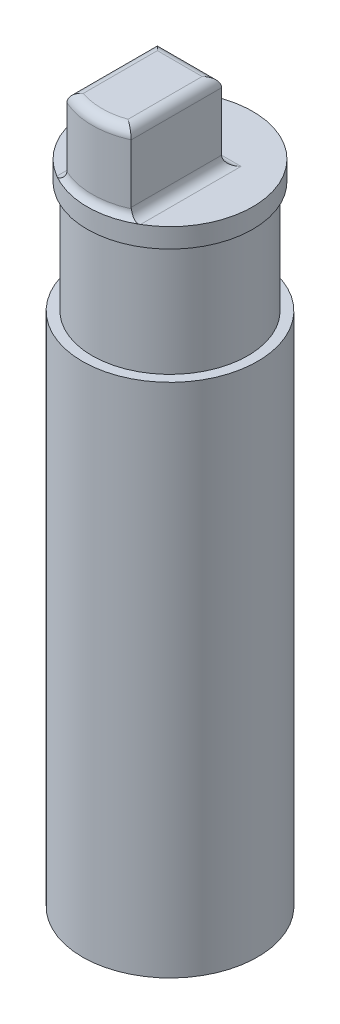
ISO-10303-21;
HEADER;
FILE_DESCRIPTION(('STEP AP214'),'2;1');
FILE_NAME('part.step','',(''),(''),'','','');
FILE_SCHEMA(('AUTOMOTIVE_DESIGN { 1 0 10303 214 1 1 1 1 }'));
ENDSEC;
DATA;
#1=APPLICATION_CONTEXT('core data for automotive mechanical design processes');
#2=APPLICATION_PROTOCOL_DEFINITION('international standard','automotive_design',2000,#1);
#3=PRODUCT_CONTEXT('',#1,'mechanical');
#4=PRODUCT('Part','Part','',(#3));
#5=PRODUCT_RELATED_PRODUCT_CATEGORY('part','',(#4));
#6=PRODUCT_DEFINITION_FORMATION('','',#4);
#7=PRODUCT_DEFINITION_CONTEXT('part definition',#1,'design');
#8=PRODUCT_DEFINITION('design','',#6,#7);
#9=PRODUCT_DEFINITION_SHAPE('','',#8);
#10=(LENGTH_UNIT() NAMED_UNIT(*) SI_UNIT(.MILLI.,.METRE.));
#11=(NAMED_UNIT(*) PLANE_ANGLE_UNIT() SI_UNIT($,.RADIAN.));
#12=(NAMED_UNIT(*) SI_UNIT($,.STERADIAN.) SOLID_ANGLE_UNIT());
#13=UNCERTAINTY_MEASURE_WITH_UNIT(LENGTH_MEASURE(1.E-05),#10,'distance_accuracy_value','');
#14=(GEOMETRIC_REPRESENTATION_CONTEXT(3) GLOBAL_UNCERTAINTY_ASSIGNED_CONTEXT((#13)) GLOBAL_UNIT_ASSIGNED_CONTEXT((#10,
#11,#12)) REPRESENTATION_CONTEXT('',''));
#15=CARTESIAN_POINT('',(0.,0.,0.));
#16=DIRECTION('',(0.,0.,1.));
#17=DIRECTION('',(1.,0.,0.));
#18=AXIS2_PLACEMENT_3D('',#15,#16,#17);
#19=CARTESIAN_POINT('',(0.,66.5,0.));
#20=DIRECTION('',(0.,1.,0.));
#21=DIRECTION('',(0.,0.,1.));
#22=AXIS2_PLACEMENT_3D('',#19,#20,#21);
#23=PLANE('',#22);
#24=DIRECTION('',(-1.,0.,0.));
#25=VECTOR('',#24,1.);
#26=CARTESIAN_POINT('',(0.,66.5,-3.));
#27=LINE('',#26,#25);
#28=CARTESIAN_POINT('',(-4.3,66.5,-3.));
#29=VERTEX_POINT('',#28);
#30=CARTESIAN_POINT('',(4.3,66.5,-3.));
#31=VERTEX_POINT('',#30);
#32=EDGE_CURVE('E151',#29,#31,#27,.F.);
#33=ORIENTED_EDGE('',*,*,#32,.T.);
#34=DIRECTION('',(0.,0.,-1.));
#35=VECTOR('',#34,1.);
#36=CARTESIAN_POINT('',(4.3,66.5,0.));
#37=LINE('',#36,#35);
#38=CARTESIAN_POINT('',(4.3,66.5,7.33212111192935));
#39=VERTEX_POINT('',#38);
#40=EDGE_CURVE('E135',#31,#39,#37,.F.);
#41=ORIENTED_EDGE('',*,*,#40,.T.);
#42=CARTESIAN_POINT('',(0.,66.5,0.));
#43=DIRECTION('',(0.,1.,0.));
#44=DIRECTION('',(0.,0.,1.));
#45=AXIS2_PLACEMENT_3D('',#42,#43,#44);
#46=CIRCLE('',#45,8.5);
#47=CARTESIAN_POINT('',(-4.3,66.5,7.33212111192935));
#48=VERTEX_POINT('',#47);
#49=EDGE_CURVE('E267',#39,#48,#46,.T.);
#50=ORIENTED_EDGE('',*,*,#49,.T.);
#51=DIRECTION('',(0.,0.,1.));
#52=VECTOR('',#51,1.);
#53=CARTESIAN_POINT('',(-4.3,66.5,0.));
#54=LINE('',#53,#52);
#55=EDGE_CURVE('E148',#48,#29,#54,.F.);
#56=ORIENTED_EDGE('',*,*,#55,.T.);
#57=EDGE_LOOP('',(#33,#41,#50,#56));
#58=FACE_BOUND('',#57,.T.);
#59=ADVANCED_FACE('F38',(#58),#23,.T.);
#60=CARTESIAN_POINT('',(0.,53.,0.));
#61=DIRECTION('',(0.,1.,0.));
#62=DIRECTION('',(0.,0.,1.));
#63=AXIS2_PLACEMENT_3D('',#60,#61,#62);
#64=PLANE('',#63);
#65=CARTESIAN_POINT('',(0.,53.,0.));
#66=DIRECTION('',(0.,1.,0.));
#67=DIRECTION('',(0.,0.,1.));
#68=AXIS2_PLACEMENT_3D('',#65,#66,#67);
#69=CIRCLE('',#68,9.);
#70=CARTESIAN_POINT('',(0.,53.,9.));
#71=VERTEX_POINT('',#70);
#72=EDGE_CURVE('E149',#71,#71,#69,.T.);
#73=ORIENTED_EDGE('',*,*,#72,.T.);
#74=EDGE_LOOP('',(#73));
#75=FACE_BOUND('',#74,.T.);
#76=CARTESIAN_POINT('',(0.,53.,0.));
#77=DIRECTION('',(0.,1.,0.));
#78=DIRECTION('',(0.,0.,1.));
#79=AXIS2_PLACEMENT_3D('',#76,#77,#78);
#80=CIRCLE('',#79,8.);
#81=CARTESIAN_POINT('',(0.,53.,8.));
#82=VERTEX_POINT('',#81);
#83=EDGE_CURVE('E270',#82,#82,#80,.T.);
#84=ORIENTED_EDGE('',*,*,#83,.F.);
#85=EDGE_LOOP('',(#84));
#86=FACE_BOUND('',#85,.T.);
#87=ADVANCED_FACE('F281',(#75,#86),#64,.T.);
#88=CARTESIAN_POINT('',(0.,53.,0.));
#89=DIRECTION('',(0.,-1.,0.));
#90=DIRECTION('',(0.,0.,-1.));
#91=AXIS2_PLACEMENT_3D('',#88,#89,#90);
#92=CYLINDRICAL_SURFACE('',#91,9.);
#93=ORIENTED_EDGE('',*,*,#72,.F.);
#94=EDGE_LOOP('',(#93));
#95=FACE_BOUND('',#94,.T.);
#96=CARTESIAN_POINT('',(0.,0.,0.));
#97=DIRECTION('',(0.,1.,0.));
#98=DIRECTION('',(0.,0.,1.));
#99=AXIS2_PLACEMENT_3D('',#96,#97,#98);
#100=CIRCLE('',#99,9.);
#101=CARTESIAN_POINT('',(0.,0.,9.));
#102=VERTEX_POINT('',#101);
#103=EDGE_CURVE('E154',#102,#102,#100,.T.);
#104=ORIENTED_EDGE('',*,*,#103,.T.);
#105=EDGE_LOOP('',(#104));
#106=FACE_BOUND('',#105,.T.);
#107=ADVANCED_FACE('F283',(#95,#106),#92,.T.);
#108=CARTESIAN_POINT('',(0.,0.,0.));
#109=DIRECTION('',(0.,1.,0.));
#110=DIRECTION('',(0.,0.,1.));
#111=AXIS2_PLACEMENT_3D('',#108,#109,#110);
#112=PLANE('',#111);
#113=ORIENTED_EDGE('',*,*,#103,.F.);
#114=EDGE_LOOP('',(#113));
#115=FACE_BOUND('',#114,.T.);
#116=ADVANCED_FACE('F290',(#115),#112,.F.);
#117=CARTESIAN_POINT('',(0.,64.5,0.));
#118=DIRECTION('',(0.,-1.,0.));
#119=DIRECTION('',(0.,0.,-1.));
#120=AXIS2_PLACEMENT_3D('',#117,#118,#119);
#121=CYLINDRICAL_SURFACE('',#120,8.);
#122=CARTESIAN_POINT('',(0.,64.5,0.));
#123=DIRECTION('',(0.,1.,0.));
#124=DIRECTION('',(0.,0.,1.));
#125=AXIS2_PLACEMENT_3D('',#122,#123,#124);
#126=CIRCLE('',#125,8.);
#127=CARTESIAN_POINT('',(0.,64.5,8.));
#128=VERTEX_POINT('',#127);
#129=EDGE_CURVE('E273',#128,#128,#126,.T.);
#130=ORIENTED_EDGE('',*,*,#129,.F.);
#131=EDGE_LOOP('',(#130));
#132=FACE_BOUND('',#131,.T.);
#133=ORIENTED_EDGE('',*,*,#83,.T.);
#134=EDGE_LOOP('',(#133));
#135=FACE_BOUND('',#134,.T.);
#136=ADVANCED_FACE('F279',(#132,#135),#121,.T.);
#137=CARTESIAN_POINT('',(0.,64.5,0.));
#138=DIRECTION('',(0.,1.,0.));
#139=DIRECTION('',(0.,0.,1.));
#140=AXIS2_PLACEMENT_3D('',#137,#138,#139);
#141=PLANE('',#140);
#142=CARTESIAN_POINT('',(0.,64.5,0.));
#143=DIRECTION('',(0.,1.,0.));
#144=DIRECTION('',(0.,0.,1.));
#145=AXIS2_PLACEMENT_3D('',#142,#143,#144);
#146=CIRCLE('',#145,8.5);
#147=CARTESIAN_POINT('',(0.,64.5,8.5));
#148=VERTEX_POINT('',#147);
#149=EDGE_CURVE('E252',#148,#148,#146,.T.);
#150=ORIENTED_EDGE('',*,*,#149,.F.);
#151=EDGE_LOOP('',(#150));
#152=FACE_BOUND('',#151,.T.);
#153=ORIENTED_EDGE('',*,*,#129,.T.);
#154=EDGE_LOOP('',(#153));
#155=FACE_BOUND('',#154,.T.);
#156=ADVANCED_FACE('F301',(#152,#155),#141,.F.);
#157=CARTESIAN_POINT('',(0.,66.5,0.));
#158=DIRECTION('',(0.,-1.,0.));
#159=DIRECTION('',(0.,0.,-1.));
#160=AXIS2_PLACEMENT_3D('',#157,#158,#159);
#161=CYLINDRICAL_SURFACE('',#160,8.5);
#162=ORIENTED_EDGE('',*,*,#49,.F.);
#163=EDGE_CURVE('E251',#48,#39,#46,.T.);
#164=ORIENTED_EDGE('',*,*,#163,.F.);
#165=EDGE_LOOP('',(#162,#164));
#166=FACE_BOUND('',#165,.T.);
#167=ORIENTED_EDGE('',*,*,#149,.T.);
#168=EDGE_LOOP('',(#167));
#169=FACE_BOUND('',#168,.T.);
#170=ADVANCED_FACE('F309',(#166,#169),#161,.T.);
#171=CARTESIAN_POINT('',(0.,74.5,0.));
#172=DIRECTION('',(0.,-1.,0.));
#173=DIRECTION('',(0.,0.,-1.));
#174=AXIS2_PLACEMENT_3D('',#171,#172,#173);
#175=CYLINDRICAL_SURFACE('',#174,8.);
#176=DIRECTION('',(0.,-1.,0.));
#177=VECTOR('',#176,1.);
#178=CARTESIAN_POINT('',(3.3,74.5,7.28766080440082));
#179=LINE('',#178,#177);
#180=CARTESIAN_POINT('',(3.3,73.5,7.28766080440082));
#181=VERTEX_POINT('',#180);
#182=CARTESIAN_POINT('',(3.3,67.5,7.28766080440082));
#183=VERTEX_POINT('',#182);
#184=EDGE_CURVE('E123',#181,#183,#179,.T.);
#185=ORIENTED_EDGE('',*,*,#184,.F.);
#186=CARTESIAN_POINT('',(0.,73.5,0.));
#187=DIRECTION('',(0.,1.,0.));
#188=DIRECTION('',(0.,0.,1.));
#189=AXIS2_PLACEMENT_3D('',#186,#187,#188);
#190=CIRCLE('',#189,8.);
#191=CARTESIAN_POINT('',(-3.3,73.5,7.28766080440082));
#192=VERTEX_POINT('',#191);
#193=EDGE_CURVE('E51',#181,#192,#190,.F.);
#194=ORIENTED_EDGE('',*,*,#193,.T.);
#195=DIRECTION('',(0.,-1.,0.));
#196=VECTOR('',#195,1.);
#197=CARTESIAN_POINT('',(-3.3,74.5,7.28766080440082));
#198=LINE('',#197,#196);
#199=CARTESIAN_POINT('',(-3.3,67.5,7.28766080440082));
#200=VERTEX_POINT('',#199);
#201=EDGE_CURVE('E201',#192,#200,#198,.T.);
#202=ORIENTED_EDGE('',*,*,#201,.T.);
#203=CARTESIAN_POINT('',(-3.3,67.5,7.28766080440082));
#204=CARTESIAN_POINT('',(-3.30000308955078,67.4775492189389,7.28766024476836));
#205=CARTESIAN_POINT('',(-3.30075590377899,67.4551592787231,7.28731921469493));
#206=CARTESIAN_POINT('',(-3.30376098159002,67.4105010799846,7.28595621366625));
#207=CARTESIAN_POINT('',(-3.30601324517264,67.3882328214619,7.28493424271109));
#208=CARTESIAN_POINT('',(-3.30901523343248,67.3660254037844,7.28357180131505));
#209=B_SPLINE_CURVE_WITH_KNOTS('',3,(#203,#204,#205,#206,#207,#208),.UNSPECIFIED.,.F.,.F.,(4,2,
4),(0.,0.0672155642898421,0.134431128570596),.UNSPECIFIED.);
#210=CARTESIAN_POINT('',(-3.30901523343248,67.3660254037844,7.28357180131505));
#211=VERTEX_POINT('',#210);
#212=EDGE_CURVE('E171',#200,#211,#209,.T.);
#213=ORIENTED_EDGE('',*,*,#212,.T.);
#214=CARTESIAN_POINT('',(0.,67.3660254037844,0.));
#215=DIRECTION('',(0.,-1.,0.));
#216=DIRECTION('',(0.,0.,-1.));
#217=AXIS2_PLACEMENT_3D('',#214,#215,#216);
#218=CIRCLE('',#217,8.);
#219=CARTESIAN_POINT('',(3.30901523343248,67.3660254037844,7.28357180131505));
#220=VERTEX_POINT('',#219);
#221=EDGE_CURVE('E162',#211,#220,#218,.F.);
#222=ORIENTED_EDGE('',*,*,#221,.T.);
#223=CARTESIAN_POINT('',(3.30901523343248,67.3660254037844,7.28357180131505));
#224=CARTESIAN_POINT('',(3.30601324517264,67.3882328214619,7.28493424271109));
#225=CARTESIAN_POINT('',(3.30376098159002,67.4105010799845,7.28595621366625));
#226=CARTESIAN_POINT('',(3.30075590377899,67.455159278723,7.28731921469493));
#227=CARTESIAN_POINT('',(3.30000308955079,67.4775492189389,7.28766024476836));
#228=CARTESIAN_POINT('',(3.3,67.5,7.28766080440082));
#229=B_SPLINE_CURVE_WITH_KNOTS('',3,(#223,#224,#225,#226,#227,#228),.UNSPECIFIED.,.F.,.F.,(4,2,
4),(0.,0.0672155642807403,0.134431128570582),.UNSPECIFIED.);
#230=EDGE_CURVE('E164',#220,#183,#229,.T.);
#231=ORIENTED_EDGE('',*,*,#230,.T.);
#232=EDGE_LOOP('',(#185,#194,#202,#213,#222,#231));
#233=FACE_BOUND('',#232,.T.);
#234=ADVANCED_FACE('F176',(#233),#175,.T.);
#235=CARTESIAN_POINT('',(3.3,74.5,7.28766080440082));
#236=DIRECTION('',(-1.,0.,0.));
#237=DIRECTION('',(0.,0.,1.));
#238=AXIS2_PLACEMENT_3D('',#235,#236,#237);
#239=PLANE('',#238);
#240=DIRECTION('',(0.,-1.,0.));
#241=VECTOR('',#240,1.);
#242=CARTESIAN_POINT('',(3.3,74.5,-2.));
#243=LINE('',#242,#241);
#244=CARTESIAN_POINT('',(3.3,73.5,-2.));
#245=VERTEX_POINT('',#244);
#246=CARTESIAN_POINT('',(3.3,67.5,-2.));
#247=VERTEX_POINT('',#246);
#248=EDGE_CURVE('E113',#245,#247,#243,.T.);
#249=ORIENTED_EDGE('',*,*,#248,.F.);
#250=DIRECTION('',(0.,0.,-1.));
#251=VECTOR('',#250,1.);
#252=CARTESIAN_POINT('',(3.3,73.5,7.28766080440082));
#253=LINE('',#252,#251);
#254=EDGE_CURVE('E11',#245,#181,#253,.F.);
#255=ORIENTED_EDGE('',*,*,#254,.T.);
#256=ORIENTED_EDGE('',*,*,#184,.T.);
#257=DIRECTION('',(0.,0.,-1.));
#258=VECTOR('',#257,1.);
#259=CARTESIAN_POINT('',(3.3,67.5,7.28766080440082));
#260=LINE('',#259,#258);
#261=EDGE_CURVE('E133',#183,#247,#260,.T.);
#262=ORIENTED_EDGE('',*,*,#261,.T.);
#263=EDGE_LOOP('',(#249,#255,#256,#262));
#264=FACE_BOUND('',#263,.T.);
#265=ADVANCED_FACE('F146',(#264),#239,.F.);
#266=CARTESIAN_POINT('',(-3.3,74.5,-2.));
#267=DIRECTION('',(0.,0.,1.));
#268=DIRECTION('',(1.,0.,0.));
#269=AXIS2_PLACEMENT_3D('',#266,#267,#268);
#270=PLANE('',#269);
#271=DIRECTION('',(0.,-1.,0.));
#272=VECTOR('',#271,1.);
#273=CARTESIAN_POINT('',(-3.3,74.5,-2.));
#274=LINE('',#273,#272);
#275=CARTESIAN_POINT('',(-3.3,73.5,-2.));
#276=VERTEX_POINT('',#275);
#277=CARTESIAN_POINT('',(-3.3,67.5,-2.));
#278=VERTEX_POINT('',#277);
#279=EDGE_CURVE('E124',#276,#278,#274,.T.);
#280=ORIENTED_EDGE('',*,*,#279,.F.);
#281=DIRECTION('',(-1.,0.,0.));
#282=VECTOR('',#281,1.);
#283=CARTESIAN_POINT('',(3.3,73.5,-2.));
#284=LINE('',#283,#282);
#285=EDGE_CURVE('E121',#276,#245,#284,.F.);
#286=ORIENTED_EDGE('',*,*,#285,.T.);
#287=ORIENTED_EDGE('',*,*,#248,.T.);
#288=DIRECTION('',(-1.,0.,0.));
#289=VECTOR('',#288,1.);
#290=CARTESIAN_POINT('',(-3.3,67.5,-2.));
#291=LINE('',#290,#289);
#292=EDGE_CURVE('E118',#247,#278,#291,.T.);
#293=ORIENTED_EDGE('',*,*,#292,.T.);
#294=EDGE_LOOP('',(#280,#286,#287,#293));
#295=FACE_BOUND('',#294,.T.);
#296=ADVANCED_FACE('F116',(#295),#270,.F.);
#297=CARTESIAN_POINT('',(-3.3,74.5,7.28766080440082));
#298=DIRECTION('',(1.,0.,0.));
#299=DIRECTION('',(0.,0.,-1.));
#300=AXIS2_PLACEMENT_3D('',#297,#298,#299);
#301=PLANE('',#300);
#302=ORIENTED_EDGE('',*,*,#201,.F.);
#303=DIRECTION('',(0.,0.,1.));
#304=VECTOR('',#303,1.);
#305=CARTESIAN_POINT('',(-3.3,73.5,-2.));
#306=LINE('',#305,#304);
#307=EDGE_CURVE('E231',#192,#276,#306,.F.);
#308=ORIENTED_EDGE('',*,*,#307,.T.);
#309=ORIENTED_EDGE('',*,*,#279,.T.);
#310=DIRECTION('',(0.,0.,1.));
#311=VECTOR('',#310,1.);
#312=CARTESIAN_POINT('',(-3.3,67.5,7.28766080440082));
#313=LINE('',#312,#311);
#314=EDGE_CURVE('E144',#278,#200,#313,.T.);
#315=ORIENTED_EDGE('',*,*,#314,.T.);
#316=EDGE_LOOP('',(#302,#308,#309,#315));
#317=FACE_BOUND('',#316,.T.);
#318=ADVANCED_FACE('F263',(#317),#301,.F.);
#319=CARTESIAN_POINT('',(0.,74.5,0.));
#320=DIRECTION('',(0.,1.,0.));
#321=DIRECTION('',(0.,0.,1.));
#322=AXIS2_PLACEMENT_3D('',#319,#320,#321);
#323=PLANE('',#322);
#324=DIRECTION('',(0.,0.,-1.));
#325=VECTOR('',#324,1.);
#326=CARTESIAN_POINT('',(2.3,74.5,-2.));
#327=LINE('',#326,#325);
#328=CARTESIAN_POINT('',(2.3,74.5,6.61135387042624));
#329=VERTEX_POINT('',#328);
#330=CARTESIAN_POINT('',(2.3,74.5,-1.));
#331=VERTEX_POINT('',#330);
#332=EDGE_CURVE('E202',#329,#331,#327,.T.);
#333=ORIENTED_EDGE('',*,*,#332,.T.);
#334=DIRECTION('',(-1.,0.,0.));
#335=VECTOR('',#334,1.);
#336=CARTESIAN_POINT('',(-3.3,74.5,-1.));
#337=LINE('',#336,#335);
#338=CARTESIAN_POINT('',(-2.3,74.5,-1.));
#339=VERTEX_POINT('',#338);
#340=EDGE_CURVE('E234',#331,#339,#337,.T.);
#341=ORIENTED_EDGE('',*,*,#340,.T.);
#342=DIRECTION('',(0.,0.,1.));
#343=VECTOR('',#342,1.);
#344=CARTESIAN_POINT('',(-2.3,74.5,7.28766080440082));
#345=LINE('',#344,#343);
#346=CARTESIAN_POINT('',(-2.3,74.5,6.61135387042624));
#347=VERTEX_POINT('',#346);
#348=EDGE_CURVE('E237',#339,#347,#345,.T.);
#349=ORIENTED_EDGE('',*,*,#348,.T.);
#350=CARTESIAN_POINT('',(0.,74.5,0.));
#351=DIRECTION('',(0.,1.,0.));
#352=DIRECTION('',(0.,0.,1.));
#353=AXIS2_PLACEMENT_3D('',#350,#351,#352);
#354=CIRCLE('',#353,7.);
#355=EDGE_CURVE('E238',#347,#329,#354,.T.);
#356=ORIENTED_EDGE('',*,*,#355,.T.);
#357=EDGE_LOOP('',(#333,#341,#349,#356));
#358=FACE_BOUND('',#357,.T.);
#359=ADVANCED_FACE('F208',(#358),#323,.T.);
#360=CARTESIAN_POINT('',(-4.3,67.5,7.28766080440082));
#361=DIRECTION('',(0.,0.,1.));
#362=DIRECTION('',(1.,0.,0.));
#363=AXIS2_PLACEMENT_3D('',#360,#361,#362);
#364=CYLINDRICAL_SURFACE('',#363,1.);
#365=CARTESIAN_POINT('',(-4.3,67.5,-3.));
#366=DIRECTION('',(-0.707106781186547,0.,0.707106781186547));
#367=DIRECTION('',(0.707106781186547,0.,0.707106781186547));
#368=AXIS2_PLACEMENT_3D('',#365,#366,#367);
#369=ELLIPSE('',#368,1.41421356237309,1.);
#370=EDGE_CURVE('E143',#29,#278,#369,.T.);
#371=ORIENTED_EDGE('',*,*,#370,.F.);
#372=ORIENTED_EDGE('',*,*,#55,.F.);
#373=CARTESIAN_POINT('',(-3.30901523343248,67.3660254037844,7.28357180131505));
#374=CARTESIAN_POINT('',(-3.31246456784373,67.3404963803781,7.28200202477436));
#375=CARTESIAN_POINT('',(-3.31690808119818,67.3150789864093,7.28105755123476));
#376=CARTESIAN_POINT('',(-3.32774503509767,67.2646608978251,7.28034614149764));
#377=CARTESIAN_POINT('',(-3.33413738508469,67.2396599783839,7.28057854785725));
#378=CARTESIAN_POINT('',(-3.35609190501821,67.1658506992066,7.28291988229461));
#379=CARTESIAN_POINT('',(-3.37447751602998,67.117899087276,7.28665451040913));
#380=CARTESIAN_POINT('',(-3.41809812552044,67.025819900509,7.29759957547721));
#381=CARTESIAN_POINT('',(-3.4433208840435,66.9816856762093,7.30480381880853));
#382=CARTESIAN_POINT('',(-3.49992307068257,66.8979753513472,7.32158795704004));
#383=CARTESIAN_POINT('',(-3.53131266951215,66.8584069544942,7.33117178347132));
#384=CARTESIAN_POINT('',(-3.60200243242958,66.7818690001788,7.35208166721237));
#385=CARTESIAN_POINT('',(-3.64171308398208,66.7453007522791,7.36348386514897));
#386=CARTESIAN_POINT('',(-3.72670871688435,66.6788771953604,7.38521996639569));
#387=CARTESIAN_POINT('',(-3.77199259093424,66.6490205561856,7.39555408116663));
#388=CARTESIAN_POINT('',(-3.85168394288901,66.6053811469845,7.4089606917193));
#389=CARTESIAN_POINT('',(-3.88475319178211,66.5895446299238,7.41330404396053));
#390=CARTESIAN_POINT('',(-3.95263959965505,66.5615556154165,7.41829416274078));
#391=CARTESIAN_POINT('',(-3.98745062103927,66.5493911161113,7.41895309818859));
#392=CARTESIAN_POINT('',(-4.05151866232284,66.5308983003173,7.41511983942148));
#393=CARTESIAN_POINT('',(-4.08063357018009,66.5239107631326,7.41154322763757));
#394=CARTESIAN_POINT('',(-4.13853512275789,66.5126821175767,7.39993050857802));
#395=CARTESIAN_POINT('',(-4.16732180753234,66.5084406704919,7.39189495151353));
#396=CARTESIAN_POINT('',(-4.21351580272938,66.5035790593016,7.37508851697309));
#397=CARTESIAN_POINT('',(-4.23132829956207,66.5022074237802,7.36759608010559));
#398=CARTESIAN_POINT('',(-4.26623472968663,66.5004176321197,7.35100849729078));
#399=CARTESIAN_POINT('',(-4.28332896583291,66.4999990700759,7.34191403540892));
#400=CARTESIAN_POINT('',(-4.3,66.5,7.33212111192935));
#401=B_SPLINE_CURVE_WITH_KNOTS('',3,(#373,#374,#375,#376,#377,#378,#379,#380,#381,#382,#383,
#384,#385,#386,#387,#388,#389,#390,#391,#392,#393,#394,#395,#396,#397,#398,#399,#400),
.UNSPECIFIED.,.F.,.F.,(4,2,2,2,2,2,2,2,2,2,2,2,2,4),(0.,0.0773705106424727,0.154697804406726,
0.308345837484571,0.461720603864883,0.615350481158227,0.780208802498562,0.945034422148909,
1.05550206044417,1.16560462922901,1.25567069587078,1.345725651289,1.40374514962373,
1.46173993339426),.UNSPECIFIED.);
#402=EDGE_CURVE('E195',#211,#48,#401,.T.);
#403=ORIENTED_EDGE('',*,*,#402,.F.);
#404=ORIENTED_EDGE('',*,*,#212,.F.);
#405=ORIENTED_EDGE('',*,*,#314,.F.);
#406=EDGE_LOOP('',(#371,#372,#403,#404,#405));
#407=FACE_BOUND('',#406,.T.);
#408=ADVANCED_FACE('F204',(#407),#364,.F.);
#409=CARTESIAN_POINT('',(0.,67.3660254037844,0.));
#410=DIRECTION('',(0.,-1.,0.));
#411=DIRECTION('',(0.,0.,-1.));
#412=AXIS2_PLACEMENT_3D('',#409,#410,#411);
#413=TOROIDAL_SURFACE('',#412,9.,1.);
#414=ORIENTED_EDGE('',*,*,#402,.T.);
#415=ORIENTED_EDGE('',*,*,#163,.T.);
#416=CARTESIAN_POINT('',(4.3,66.5,7.33212111192934));
#417=CARTESIAN_POINT('',(4.28439517078444,66.5000011961552,7.3412789345809));
#418=CARTESIAN_POINT('',(4.26843028838506,66.5003664663718,7.3498319844296));
#419=CARTESIAN_POINT('',(4.2358612452299,66.501924873276,7.3655497771866));
#420=CARTESIAN_POINT('',(4.21925671596317,66.5031184941361,7.3727137050157));
#421=CARTESIAN_POINT('',(4.16927392109373,66.508028140556,7.39159610269089));
#422=CARTESIAN_POINT('',(4.13512630259104,66.5130660964168,7.40106597279926));
#423=CARTESIAN_POINT('',(4.06642234586707,66.5270266219958,7.413802103621));
#424=CARTESIAN_POINT('',(4.0318650411024,66.5359617405964,7.41704813982387));
#425=CARTESIAN_POINT('',(3.96372640707345,66.5575518636163,7.41872610732216));
#426=CARTESIAN_POINT('',(3.9301502266978,66.5702235881686,7.41713609435254));
#427=CARTESIAN_POINT('',(3.85089164965909,66.60507387946,7.40950934174041));
#428=CARTESIAN_POINT('',(3.80614888753835,66.6290024643583,7.40186616930271));
#429=CARTESIAN_POINT('',(3.72113978437736,66.6830134034114,7.38401132081926));
#430=CARTESIAN_POINT('',(3.68087985861722,66.7131044060787,7.37379603031466));
#431=CARTESIAN_POINT('',(3.60373983535505,66.7803171033482,7.35270369550476));
#432=CARTESIAN_POINT('',(3.56707251309643,66.8176808758705,7.34181687162733));
#433=CARTESIAN_POINT('',(3.49983944260301,66.8979355947281,7.32164561247554));
#434=CARTESIAN_POINT('',(3.46927292809012,66.9408258458075,7.31236097598193));
#435=CARTESIAN_POINT('',(3.41297343171011,67.0348017941752,7.29621895245351));
#436=CARTESIAN_POINT('',(3.38779399867238,67.086264267508,7.28960356800613));
#437=CARTESIAN_POINT('',(3.34657048016316,67.1930387075782,7.28134147394502));
#438=CARTESIAN_POINT('',(3.33050048508431,67.2483392491354,7.27968061435493));
#439=CARTESIAN_POINT('',(3.31727140319661,67.3146496942701,7.28120814671517));
#440=CARTESIAN_POINT('',(3.31539373952559,67.3249006505036,7.28154182930495));
#441=CARTESIAN_POINT('',(3.31196276072953,67.3454364537915,7.28240758751987));
#442=CARTESIAN_POINT('',(3.31040908179199,67.3557212495138,7.28293943872379));
#443=CARTESIAN_POINT('',(3.30901523343248,67.3660254037844,7.28357180131505));
#444=B_SPLINE_CURVE_WITH_KNOTS('',3,(#416,#417,#418,#419,#420,#421,#422,#423,#424,#425,#426,
#427,#428,#429,#430,#431,#432,#433,#434,#435,#436,#437,#438,#439,#440,#441,#442,#443),
.UNSPECIFIED.,.F.,.F.,(4,2,2,2,2,2,2,2,2,2,2,2,2,4),(0.,0.0542639799180423,0.108559703976039,
0.215089415553723,0.321964715384058,0.429325699568787,0.582445952381603,0.735782589563756,
0.895554918787222,1.05530716752401,1.22736264918168,1.39892627277646,1.43020373788822,
1.46144588914484),.UNSPECIFIED.);
#445=EDGE_CURVE('E138',#220,#39,#444,.F.);
#446=ORIENTED_EDGE('',*,*,#445,.F.);
#447=ORIENTED_EDGE('',*,*,#221,.F.);
#448=EDGE_LOOP('',(#414,#415,#446,#447));
#449=FACE_BOUND('',#448,.T.);
#450=ADVANCED_FACE('F185',(#449),#413,.F.);
#451=CARTESIAN_POINT('',(-3.3,67.5,-3.));
#452=DIRECTION('',(-1.,0.,0.));
#453=DIRECTION('',(0.,0.,1.));
#454=AXIS2_PLACEMENT_3D('',#451,#452,#453);
#455=CYLINDRICAL_SURFACE('',#454,1.);
#456=ORIENTED_EDGE('',*,*,#370,.T.);
#457=ORIENTED_EDGE('',*,*,#292,.F.);
#458=CARTESIAN_POINT('',(4.3,67.5,-3.));
#459=DIRECTION('',(-0.707106781186547,0.,-0.707106781186547));
#460=DIRECTION('',(-0.707106781186547,0.,0.707106781186547));
#461=AXIS2_PLACEMENT_3D('',#458,#459,#460);
#462=ELLIPSE('',#461,1.41421356237309,1.);
#463=EDGE_CURVE('E130',#31,#247,#462,.T.);
#464=ORIENTED_EDGE('',*,*,#463,.F.);
#465=ORIENTED_EDGE('',*,*,#32,.F.);
#466=EDGE_LOOP('',(#456,#457,#464,#465));
#467=FACE_BOUND('',#466,.T.);
#468=ADVANCED_FACE('F141',(#467),#455,.F.);
#469=CARTESIAN_POINT('',(4.3,67.5,7.28766080440082));
#470=DIRECTION('',(0.,0.,-1.));
#471=DIRECTION('',(-1.,0.,0.));
#472=AXIS2_PLACEMENT_3D('',#469,#470,#471);
#473=CYLINDRICAL_SURFACE('',#472,1.);
#474=ORIENTED_EDGE('',*,*,#445,.T.);
#475=ORIENTED_EDGE('',*,*,#40,.F.);
#476=ORIENTED_EDGE('',*,*,#463,.T.);
#477=ORIENTED_EDGE('',*,*,#261,.F.);
#478=ORIENTED_EDGE('',*,*,#230,.F.);
#479=EDGE_LOOP('',(#474,#475,#476,#477,#478));
#480=FACE_BOUND('',#479,.T.);
#481=ADVANCED_FACE('F131',(#480),#473,.F.);
#482=CARTESIAN_POINT('',(0.,73.5,0.));
#483=DIRECTION('',(0.,1.,0.));
#484=DIRECTION('',(0.,0.,1.));
#485=AXIS2_PLACEMENT_3D('',#482,#483,#484);
#486=TOROIDAL_SURFACE('',#485,7.,1.);
#487=CARTESIAN_POINT('',(-3.3,73.5,7.28766080440082));
#488=CARTESIAN_POINT('',(-3.30000176598192,73.524876489365,7.28766170084426));
#489=CARTESIAN_POINT('',(-3.29907100557897,73.5497397531213,7.28706169582455));
#490=CARTESIAN_POINT('',(-3.2953708391555,73.5992626903483,7.28467487474623));
#491=CARTESIAN_POINT('',(-3.2926021128021,73.6239224356672,7.2828884973998));
#492=CARTESIAN_POINT('',(-3.28161849442464,73.6970856006233,7.27579805565608));
#493=CARTESIAN_POINT('',(-3.2707254894552,73.7450539326873,7.2687622896408));
#494=CARTESIAN_POINT('',(-3.24238653175542,73.8380433022348,7.25041489096021));
#495=CARTESIAN_POINT('',(-3.22494732974951,73.8830673200504,7.23910766313671));
#496=CARTESIAN_POINT('',(-3.18433559853819,73.969279610292,7.21269219314641));
#497=CARTESIAN_POINT('',(-3.16115758981238,74.0104641646895,7.1975803179974));
#498=CARTESIAN_POINT('',(-3.10856896477404,74.090453741343,7.16315991408348));
#499=CARTESIAN_POINT('',(-3.07888053901026,74.128993515251,7.14366275144372));
#500=CARTESIAN_POINT('',(-3.01525615276345,74.2005009553184,7.10167928751696));
#501=CARTESIAN_POINT('',(-2.98131934835148,74.2334675113064,7.0791923922724));
#502=CARTESIAN_POINT('',(-2.90483908490536,74.2981477312189,7.02824503341315));
#503=CARTESIAN_POINT('',(-2.8617685081976,74.3289295810006,6.99939463828733));
#504=CARTESIAN_POINT('',(-2.7725909220806,74.3828240755794,6.93925512757329));
#505=CARTESIAN_POINT('',(-2.72647989796252,74.4059263267226,6.90796277712619));
#506=CARTESIAN_POINT('',(-2.61888920977062,74.4500468829142,6.83441772253536));
#507=CARTESIAN_POINT('',(-2.55678352912075,74.4685826823806,6.79158850727184));
#508=CARTESIAN_POINT('',(-2.43145192747978,74.4933738033791,6.70429333068518));
#509=CARTESIAN_POINT('',(-2.36822832009987,74.4996520388908,6.6598305819516));
#510=CARTESIAN_POINT('',(-2.30353615788301,74.4999953143804,6.61386736377378));
#511=CARTESIAN_POINT('',(-2.30176795033372,74.5000000030202,6.61261070667262));
#512=CARTESIAN_POINT('',(-2.3,74.5,6.61135387042624));
#513=B_SPLINE_CURVE_WITH_KNOTS('',3,(#487,#488,#489,#490,#491,#492,#493,#494,#495,#496,#497,
#498,#499,#500,#501,#502,#503,#504,#505,#506,#507,#508,#509,#510,#511,#512),.UNSPECIFIED.,.F.,
.F.,(4,2,2,2,2,2,2,2,2,2,2,2,4),(0.,0.0745791732011389,0.149130782891435,0.297402770257779,
0.44552227127473,0.593783748680686,0.750407939797004,0.907063293404466,1.08724691805736,
1.2676734216777,1.49966445142829,1.73122138620453,1.73772919572512),.UNSPECIFIED.);
#514=EDGE_CURVE('E220',#192,#347,#513,.T.);
#515=ORIENTED_EDGE('',*,*,#514,.F.);
#516=ORIENTED_EDGE('',*,*,#193,.F.);
#517=CARTESIAN_POINT('',(3.3,73.5,7.28766080440082));
#518=CARTESIAN_POINT('',(3.30000176598193,73.524876489365,7.28766170084426));
#519=CARTESIAN_POINT('',(3.29907100557897,73.5497397531213,7.28706169582455));
#520=CARTESIAN_POINT('',(3.2953708391555,73.5992626903483,7.28467487474623));
#521=CARTESIAN_POINT('',(3.2926021128021,73.6239224356672,7.2828884973998));
#522=CARTESIAN_POINT('',(3.28161849442464,73.6970856006233,7.27579805565608));
#523=CARTESIAN_POINT('',(3.2707254894552,73.7450539326873,7.2687622896408));
#524=CARTESIAN_POINT('',(3.24238653175542,73.8380433022348,7.25041489096021));
#525=CARTESIAN_POINT('',(3.22494732974951,73.8830673200504,7.23910766313671));
#526=CARTESIAN_POINT('',(3.18433559853819,73.969279610292,7.21269219314641));
#527=CARTESIAN_POINT('',(3.16115758981238,74.0104641646895,7.1975803179974));
#528=CARTESIAN_POINT('',(3.10856896477404,74.090453741343,7.16315991408348));
#529=CARTESIAN_POINT('',(3.07888053901026,74.128993515251,7.14366275144372));
#530=CARTESIAN_POINT('',(3.01525615276345,74.2005009553184,7.10167928751696));
#531=CARTESIAN_POINT('',(2.98131934835148,74.2334675113064,7.0791923922724));
#532=CARTESIAN_POINT('',(2.90483908490536,74.2981477312189,7.02824503341315));
#533=CARTESIAN_POINT('',(2.8617685081976,74.3289295810006,6.99939463828733));
#534=CARTESIAN_POINT('',(2.7725909220806,74.3828240755794,6.93925512757329));
#535=CARTESIAN_POINT('',(2.72647989796252,74.4059263267226,6.90796277712619));
#536=CARTESIAN_POINT('',(2.61888920977062,74.4500468829142,6.83441772253536));
#537=CARTESIAN_POINT('',(2.55678352912075,74.4685826823806,6.79158850727183));
#538=CARTESIAN_POINT('',(2.43145192747978,74.4933738033791,6.70429333068518));
#539=CARTESIAN_POINT('',(2.36822832009987,74.4996520388908,6.65983058195161));
#540=CARTESIAN_POINT('',(2.30353615788301,74.4999953143804,6.61386736377378));
#541=CARTESIAN_POINT('',(2.30176795033372,74.5000000030202,6.61261070667263));
#542=CARTESIAN_POINT('',(2.3,74.5,6.61135387042624));
#543=B_SPLINE_CURVE_WITH_KNOTS('',3,(#517,#518,#519,#520,#521,#522,#523,#524,#525,#526,#527,
#528,#529,#530,#531,#532,#533,#534,#535,#536,#537,#538,#539,#540,#541,#542),.UNSPECIFIED.,.F.,
.F.,(4,2,2,2,2,2,2,2,2,2,2,2,4),(0.,0.0745791732011389,0.149130782891434,0.297402770257779,
0.44552227127473,0.593783748680686,0.750407939797004,0.907063293404466,1.08724691805736,
1.2676734216777,1.49966445142829,1.73122138620453,1.73772919572512),.UNSPECIFIED.);
#544=EDGE_CURVE('E43',#329,#181,#543,.F.);
#545=ORIENTED_EDGE('',*,*,#544,.F.);
#546=ORIENTED_EDGE('',*,*,#355,.F.);
#547=EDGE_LOOP('',(#515,#516,#545,#546));
#548=FACE_BOUND('',#547,.T.);
#549=ADVANCED_FACE('F184',(#548),#486,.T.);
#550=CARTESIAN_POINT('',(2.3,73.5,0.));
#551=DIRECTION('',(0.,0.,1.));
#552=DIRECTION('',(1.,0.,0.));
#553=AXIS2_PLACEMENT_3D('',#550,#551,#552);
#554=CYLINDRICAL_SURFACE('',#553,1.);
#555=ORIENTED_EDGE('',*,*,#544,.T.);
#556=ORIENTED_EDGE('',*,*,#254,.F.);
#557=CARTESIAN_POINT('',(2.3,73.5,-1.));
#558=DIRECTION('',(0.707106781186547,0.,0.707106781186547));
#559=DIRECTION('',(-0.707106781186547,0.,0.707106781186547));
#560=AXIS2_PLACEMENT_3D('',#557,#558,#559);
#561=ELLIPSE('',#560,1.41421356237309,1.);
#562=EDGE_CURVE('E226',#331,#245,#561,.F.);
#563=ORIENTED_EDGE('',*,*,#562,.F.);
#564=ORIENTED_EDGE('',*,*,#332,.F.);
#565=EDGE_LOOP('',(#555,#556,#563,#564));
#566=FACE_BOUND('',#565,.T.);
#567=ADVANCED_FACE('F40',(#566),#554,.T.);
#568=CARTESIAN_POINT('',(-2.3,73.5,0.));
#569=DIRECTION('',(0.,0.,-1.));
#570=DIRECTION('',(-1.,0.,0.));
#571=AXIS2_PLACEMENT_3D('',#568,#569,#570);
#572=CYLINDRICAL_SURFACE('',#571,1.);
#573=ORIENTED_EDGE('',*,*,#514,.T.);
#574=ORIENTED_EDGE('',*,*,#348,.F.);
#575=CARTESIAN_POINT('',(-2.3,73.5,-1.));
#576=DIRECTION('',(0.707106781186547,0.,-0.707106781186547));
#577=DIRECTION('',(-0.707106781186547,0.,-0.707106781186547));
#578=AXIS2_PLACEMENT_3D('',#575,#576,#577);
#579=ELLIPSE('',#578,1.41421356237309,1.);
#580=EDGE_CURVE('E228',#276,#339,#579,.T.);
#581=ORIENTED_EDGE('',*,*,#580,.F.);
#582=ORIENTED_EDGE('',*,*,#307,.F.);
#583=EDGE_LOOP('',(#573,#574,#581,#582));
#584=FACE_BOUND('',#583,.T.);
#585=ADVANCED_FACE('F214',(#584),#572,.T.);
#586=CARTESIAN_POINT('',(0.,73.5,-1.));
#587=DIRECTION('',(1.,0.,0.));
#588=DIRECTION('',(0.,0.,-1.));
#589=AXIS2_PLACEMENT_3D('',#586,#587,#588);
#590=CYLINDRICAL_SURFACE('',#589,1.);
#591=ORIENTED_EDGE('',*,*,#562,.T.);
#592=ORIENTED_EDGE('',*,*,#285,.F.);
#593=ORIENTED_EDGE('',*,*,#580,.T.);
#594=ORIENTED_EDGE('',*,*,#340,.F.);
#595=EDGE_LOOP('',(#591,#592,#593,#594));
#596=FACE_BOUND('',#595,.T.);
#597=ADVANCED_FACE('F210',(#596),#590,.T.);
#598=CLOSED_SHELL('',(#59,#87,#107,#116,#136,#156,#170,#234,#265,#296,#318,#359,#408,#450,#468,
#481,#549,#567,#585,#597));
#599=MANIFOLD_SOLID_BREP('B2',#598);
#600=ADVANCED_BREP_SHAPE_REPRESENTATION('',(#18,#599),#14);
#601=SHAPE_DEFINITION_REPRESENTATION(#9,#600);
ENDSEC;
END-ISO-10303-21;
